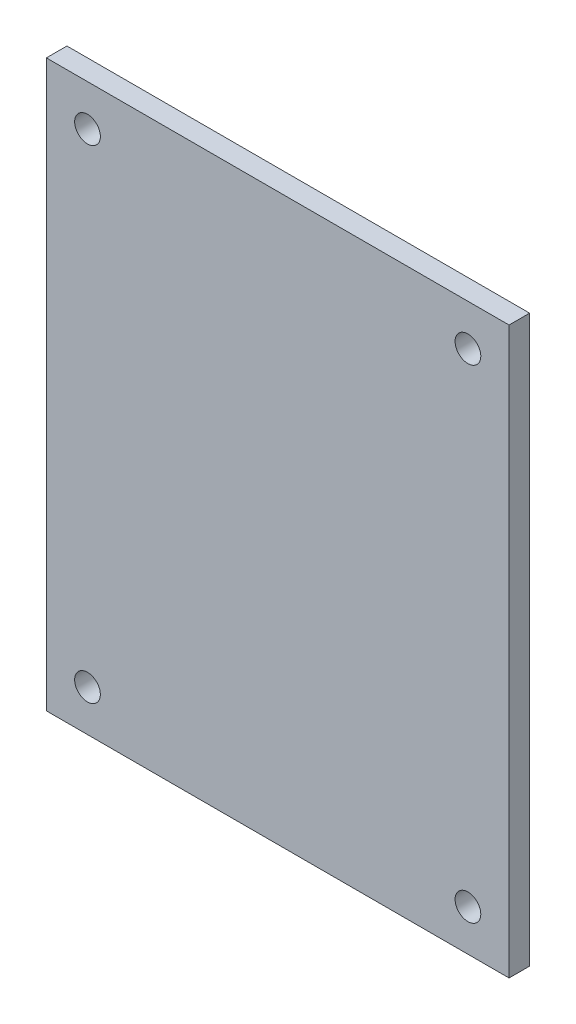
ISO-10303-21;
HEADER;
FILE_DESCRIPTION(('STEP AP214'),'2;1');
FILE_NAME('part.step','',(''),(''),'','','');
FILE_SCHEMA(('AUTOMOTIVE_DESIGN { 1 0 10303 214 1 1 1 1 }'));
ENDSEC;
DATA;
#1=APPLICATION_CONTEXT('core data for automotive mechanical design processes');
#2=APPLICATION_PROTOCOL_DEFINITION('international standard','automotive_design',2000,#1);
#3=PRODUCT_CONTEXT('',#1,'mechanical');
#4=PRODUCT('Part','Part','',(#3));
#5=PRODUCT_RELATED_PRODUCT_CATEGORY('part','',(#4));
#6=PRODUCT_DEFINITION_FORMATION('','',#4);
#7=PRODUCT_DEFINITION_CONTEXT('part definition',#1,'design');
#8=PRODUCT_DEFINITION('design','',#6,#7);
#9=PRODUCT_DEFINITION_SHAPE('','',#8);
#10=(LENGTH_UNIT() NAMED_UNIT(*) SI_UNIT(.MILLI.,.METRE.));
#11=(NAMED_UNIT(*) PLANE_ANGLE_UNIT() SI_UNIT($,.RADIAN.));
#12=(NAMED_UNIT(*) SI_UNIT($,.STERADIAN.) SOLID_ANGLE_UNIT());
#13=UNCERTAINTY_MEASURE_WITH_UNIT(LENGTH_MEASURE(1.E-05),#10,'distance_accuracy_value','');
#14=(GEOMETRIC_REPRESENTATION_CONTEXT(3) GLOBAL_UNCERTAINTY_ASSIGNED_CONTEXT((#13)) GLOBAL_UNIT_ASSIGNED_CONTEXT((#10,
#11,#12)) REPRESENTATION_CONTEXT('',''));
#15=CARTESIAN_POINT('',(0.,0.,0.));
#16=DIRECTION('',(0.,0.,1.));
#17=DIRECTION('',(1.,0.,0.));
#18=AXIS2_PLACEMENT_3D('',#15,#16,#17);
#19=CARTESIAN_POINT('',(0.,0.,2.));
#20=DIRECTION('',(0.,0.,-1.));
#21=DIRECTION('',(-1.,0.,0.));
#22=AXIS2_PLACEMENT_3D('',#19,#20,#21);
#23=PLANE('',#22);
#24=DIRECTION('',(0.,1.,0.));
#25=VECTOR('',#24,1.);
#26=CARTESIAN_POINT('',(22.5,-27.5,2.));
#27=LINE('',#26,#25);
#28=CARTESIAN_POINT('',(22.5,-27.5,2.));
#29=VERTEX_POINT('',#28);
#30=CARTESIAN_POINT('',(22.5,27.5,2.));
#31=VERTEX_POINT('',#30);
#32=EDGE_CURVE('E85',#29,#31,#27,.T.);
#33=ORIENTED_EDGE('',*,*,#32,.T.);
#34=DIRECTION('',(-1.,0.,0.));
#35=VECTOR('',#34,1.);
#36=CARTESIAN_POINT('',(-22.5,27.5,2.));
#37=LINE('',#36,#35);
#38=CARTESIAN_POINT('',(-22.5,27.5,2.));
#39=VERTEX_POINT('',#38);
#40=EDGE_CURVE('E80',#31,#39,#37,.T.);
#41=ORIENTED_EDGE('',*,*,#40,.T.);
#42=DIRECTION('',(0.,-1.,0.));
#43=VECTOR('',#42,1.);
#44=CARTESIAN_POINT('',(-22.5,-27.5,2.));
#45=LINE('',#44,#43);
#46=CARTESIAN_POINT('',(-22.5,-27.5,2.));
#47=VERTEX_POINT('',#46);
#48=EDGE_CURVE('E83',#39,#47,#45,.T.);
#49=ORIENTED_EDGE('',*,*,#48,.T.);
#50=DIRECTION('',(1.,0.,0.));
#51=VECTOR('',#50,1.);
#52=CARTESIAN_POINT('',(-22.5,-27.5,2.));
#53=LINE('',#52,#51);
#54=EDGE_CURVE('E50',#47,#29,#53,.T.);
#55=ORIENTED_EDGE('',*,*,#54,.T.);
#56=EDGE_LOOP('',(#33,#41,#49,#55));
#57=FACE_BOUND('',#56,.T.);
#58=CARTESIAN_POINT('',(-18.5,23.5,2.));
#59=DIRECTION('',(0.,0.,1.));
#60=DIRECTION('',(1.,0.,0.));
#61=AXIS2_PLACEMENT_3D('',#58,#59,#60);
#62=CIRCLE('',#61,1.25);
#63=CARTESIAN_POINT('',(-17.25,23.5,2.));
#64=VERTEX_POINT('',#63);
#65=EDGE_CURVE('E100',#64,#64,#62,.T.);
#66=ORIENTED_EDGE('',*,*,#65,.F.);
#67=EDGE_LOOP('',(#66));
#68=FACE_BOUND('',#67,.T.);
#69=CARTESIAN_POINT('',(18.5,23.5,2.));
#70=DIRECTION('',(0.,0.,1.));
#71=DIRECTION('',(-1.,0.,0.));
#72=AXIS2_PLACEMENT_3D('',#69,#70,#71);
#73=CIRCLE('',#72,1.25);
#74=CARTESIAN_POINT('',(17.25,23.5,2.));
#75=VERTEX_POINT('',#74);
#76=EDGE_CURVE('E115',#75,#75,#73,.T.);
#77=ORIENTED_EDGE('',*,*,#76,.F.);
#78=EDGE_LOOP('',(#77));
#79=FACE_BOUND('',#78,.T.);
#80=CARTESIAN_POINT('',(18.5,-23.5,2.));
#81=DIRECTION('',(0.,0.,1.));
#82=DIRECTION('',(1.,0.,0.));
#83=AXIS2_PLACEMENT_3D('',#80,#81,#82);
#84=CIRCLE('',#83,1.25);
#85=CARTESIAN_POINT('',(19.75,-23.5,2.));
#86=VERTEX_POINT('',#85);
#87=EDGE_CURVE('E121',#86,#86,#84,.T.);
#88=ORIENTED_EDGE('',*,*,#87,.F.);
#89=EDGE_LOOP('',(#88));
#90=FACE_BOUND('',#89,.T.);
#91=CARTESIAN_POINT('',(-18.5,-23.5,2.));
#92=DIRECTION('',(0.,0.,1.));
#93=DIRECTION('',(-1.,0.,0.));
#94=AXIS2_PLACEMENT_3D('',#91,#92,#93);
#95=CIRCLE('',#94,1.25);
#96=CARTESIAN_POINT('',(-19.75,-23.5,2.));
#97=VERTEX_POINT('',#96);
#98=EDGE_CURVE('E127',#97,#97,#95,.T.);
#99=ORIENTED_EDGE('',*,*,#98,.F.);
#100=EDGE_LOOP('',(#99));
#101=FACE_BOUND('',#100,.T.);
#102=ADVANCED_FACE('F33',(#57,#68,#79,#90,#101),#23,.F.);
#103=CARTESIAN_POINT('',(0.,0.,0.));
#104=DIRECTION('',(0.,0.,-1.));
#105=DIRECTION('',(-1.,0.,0.));
#106=AXIS2_PLACEMENT_3D('',#103,#104,#105);
#107=PLANE('',#106);
#108=CARTESIAN_POINT('',(18.5,-23.5,0.));
#109=DIRECTION('',(0.,0.,1.));
#110=DIRECTION('',(1.,0.,0.));
#111=AXIS2_PLACEMENT_3D('',#108,#109,#110);
#112=CIRCLE('',#111,1.25);
#113=CARTESIAN_POINT('',(19.75,-23.5,0.));
#114=VERTEX_POINT('',#113);
#115=EDGE_CURVE('E124',#114,#114,#112,.T.);
#116=ORIENTED_EDGE('',*,*,#115,.T.);
#117=EDGE_LOOP('',(#116));
#118=FACE_BOUND('',#117,.T.);
#119=CARTESIAN_POINT('',(-18.5,23.5,0.));
#120=DIRECTION('',(0.,0.,1.));
#121=DIRECTION('',(1.,0.,0.));
#122=AXIS2_PLACEMENT_3D('',#119,#120,#121);
#123=CIRCLE('',#122,1.25);
#124=CARTESIAN_POINT('',(-17.25,23.5,0.));
#125=VERTEX_POINT('',#124);
#126=EDGE_CURVE('E112',#125,#125,#123,.T.);
#127=ORIENTED_EDGE('',*,*,#126,.T.);
#128=EDGE_LOOP('',(#127));
#129=FACE_BOUND('',#128,.T.);
#130=DIRECTION('',(0.,1.,0.));
#131=VECTOR('',#130,1.);
#132=CARTESIAN_POINT('',(22.5,-27.5,0.));
#133=LINE('',#132,#131);
#134=CARTESIAN_POINT('',(22.5,-27.5,0.));
#135=VERTEX_POINT('',#134);
#136=CARTESIAN_POINT('',(22.5,27.5,0.));
#137=VERTEX_POINT('',#136);
#138=EDGE_CURVE('E97',#135,#137,#133,.T.);
#139=ORIENTED_EDGE('',*,*,#138,.F.);
#140=DIRECTION('',(1.,0.,0.));
#141=VECTOR('',#140,1.);
#142=CARTESIAN_POINT('',(-22.5,-27.5,0.));
#143=LINE('',#142,#141);
#144=CARTESIAN_POINT('',(-22.5,-27.5,0.));
#145=VERTEX_POINT('',#144);
#146=EDGE_CURVE('E73',#145,#135,#143,.T.);
#147=ORIENTED_EDGE('',*,*,#146,.F.);
#148=DIRECTION('',(0.,-1.,0.));
#149=VECTOR('',#148,1.);
#150=CARTESIAN_POINT('',(-22.5,-27.5,0.));
#151=LINE('',#150,#149);
#152=CARTESIAN_POINT('',(-22.5,27.5,0.));
#153=VERTEX_POINT('',#152);
#154=EDGE_CURVE('E67',#153,#145,#151,.T.);
#155=ORIENTED_EDGE('',*,*,#154,.F.);
#156=DIRECTION('',(-1.,0.,0.));
#157=VECTOR('',#156,1.);
#158=CARTESIAN_POINT('',(-22.5,27.5,0.));
#159=LINE('',#158,#157);
#160=EDGE_CURVE('E89',#137,#153,#159,.T.);
#161=ORIENTED_EDGE('',*,*,#160,.F.);
#162=EDGE_LOOP('',(#139,#147,#155,#161));
#163=FACE_BOUND('',#162,.T.);
#164=CARTESIAN_POINT('',(18.5,23.5,0.));
#165=DIRECTION('',(0.,0.,1.));
#166=DIRECTION('',(-1.,0.,0.));
#167=AXIS2_PLACEMENT_3D('',#164,#165,#166);
#168=CIRCLE('',#167,1.25);
#169=CARTESIAN_POINT('',(17.25,23.5,0.));
#170=VERTEX_POINT('',#169);
#171=EDGE_CURVE('E118',#170,#170,#168,.T.);
#172=ORIENTED_EDGE('',*,*,#171,.T.);
#173=EDGE_LOOP('',(#172));
#174=FACE_BOUND('',#173,.T.);
#175=CARTESIAN_POINT('',(-18.5,-23.5,0.));
#176=DIRECTION('',(0.,0.,1.));
#177=DIRECTION('',(-1.,0.,0.));
#178=AXIS2_PLACEMENT_3D('',#175,#176,#177);
#179=CIRCLE('',#178,1.25);
#180=CARTESIAN_POINT('',(-19.75,-23.5,0.));
#181=VERTEX_POINT('',#180);
#182=EDGE_CURVE('E130',#181,#181,#179,.T.);
#183=ORIENTED_EDGE('',*,*,#182,.T.);
#184=EDGE_LOOP('',(#183));
#185=FACE_BOUND('',#184,.T.);
#186=ADVANCED_FACE('F108',(#118,#129,#163,#174,#185),#107,.T.);
#187=CARTESIAN_POINT('',(22.5,-27.5,2.));
#188=DIRECTION('',(-1.,0.,0.));
#189=DIRECTION('',(0.,-1.,0.));
#190=AXIS2_PLACEMENT_3D('',#187,#188,#189);
#191=PLANE('',#190);
#192=ORIENTED_EDGE('',*,*,#138,.T.);
#193=DIRECTION('',(0.,0.,-1.));
#194=VECTOR('',#193,1.);
#195=CARTESIAN_POINT('',(22.5,27.5,2.));
#196=LINE('',#195,#194);
#197=EDGE_CURVE('E11',#31,#137,#196,.T.);
#198=ORIENTED_EDGE('',*,*,#197,.F.);
#199=ORIENTED_EDGE('',*,*,#32,.F.);
#200=DIRECTION('',(0.,0.,-1.));
#201=VECTOR('',#200,1.);
#202=CARTESIAN_POINT('',(22.5,-27.5,2.));
#203=LINE('',#202,#201);
#204=EDGE_CURVE('E93',#29,#135,#203,.T.);
#205=ORIENTED_EDGE('',*,*,#204,.T.);
#206=EDGE_LOOP('',(#192,#198,#199,#205));
#207=FACE_BOUND('',#206,.T.);
#208=ADVANCED_FACE('F35',(#207),#191,.F.);
#209=CARTESIAN_POINT('',(-22.5,27.5,2.));
#210=DIRECTION('',(0.,-1.,0.));
#211=DIRECTION('',(0.,0.,-1.));
#212=AXIS2_PLACEMENT_3D('',#209,#210,#211);
#213=PLANE('',#212);
#214=ORIENTED_EDGE('',*,*,#160,.T.);
#215=DIRECTION('',(0.,0.,-1.));
#216=VECTOR('',#215,1.);
#217=CARTESIAN_POINT('',(-22.5,27.5,2.));
#218=LINE('',#217,#216);
#219=EDGE_CURVE('E42',#39,#153,#218,.T.);
#220=ORIENTED_EDGE('',*,*,#219,.F.);
#221=ORIENTED_EDGE('',*,*,#40,.F.);
#222=ORIENTED_EDGE('',*,*,#197,.T.);
#223=EDGE_LOOP('',(#214,#220,#221,#222));
#224=FACE_BOUND('',#223,.T.);
#225=ADVANCED_FACE('F88',(#224),#213,.F.);
#226=CARTESIAN_POINT('',(-22.5,-27.5,2.));
#227=DIRECTION('',(1.,0.,0.));
#228=DIRECTION('',(0.,1.,0.));
#229=AXIS2_PLACEMENT_3D('',#226,#227,#228);
#230=PLANE('',#229);
#231=ORIENTED_EDGE('',*,*,#154,.T.);
#232=DIRECTION('',(0.,0.,-1.));
#233=VECTOR('',#232,1.);
#234=CARTESIAN_POINT('',(-22.5,-27.5,2.));
#235=LINE('',#234,#233);
#236=EDGE_CURVE('E90',#47,#145,#235,.T.);
#237=ORIENTED_EDGE('',*,*,#236,.F.);
#238=ORIENTED_EDGE('',*,*,#48,.F.);
#239=ORIENTED_EDGE('',*,*,#219,.T.);
#240=EDGE_LOOP('',(#231,#237,#238,#239));
#241=FACE_BOUND('',#240,.T.);
#242=ADVANCED_FACE('F91',(#241),#230,.F.);
#243=CARTESIAN_POINT('',(-22.5,-27.5,2.));
#244=DIRECTION('',(0.,1.,0.));
#245=DIRECTION('',(0.,0.,1.));
#246=AXIS2_PLACEMENT_3D('',#243,#244,#245);
#247=PLANE('',#246);
#248=ORIENTED_EDGE('',*,*,#146,.T.);
#249=ORIENTED_EDGE('',*,*,#204,.F.);
#250=ORIENTED_EDGE('',*,*,#54,.F.);
#251=ORIENTED_EDGE('',*,*,#236,.T.);
#252=EDGE_LOOP('',(#248,#249,#250,#251));
#253=FACE_BOUND('',#252,.T.);
#254=ADVANCED_FACE('F105',(#253),#247,.F.);
#255=CARTESIAN_POINT('',(-18.5,23.5,2.));
#256=DIRECTION('',(0.,0.,-1.));
#257=DIRECTION('',(-1.,0.,0.));
#258=AXIS2_PLACEMENT_3D('',#255,#256,#257);
#259=CYLINDRICAL_SURFACE('',#258,1.25);
#260=ORIENTED_EDGE('',*,*,#65,.T.);
#261=EDGE_LOOP('',(#260));
#262=FACE_BOUND('',#261,.T.);
#263=ORIENTED_EDGE('',*,*,#126,.F.);
#264=EDGE_LOOP('',(#263));
#265=FACE_BOUND('',#264,.T.);
#266=ADVANCED_FACE('F147',(#262,#265),#259,.F.);
#267=CARTESIAN_POINT('',(18.5,23.5,2.));
#268=DIRECTION('',(0.,0.,-1.));
#269=DIRECTION('',(-1.,0.,0.));
#270=AXIS2_PLACEMENT_3D('',#267,#268,#269);
#271=CYLINDRICAL_SURFACE('',#270,1.25);
#272=ORIENTED_EDGE('',*,*,#76,.T.);
#273=EDGE_LOOP('',(#272));
#274=FACE_BOUND('',#273,.T.);
#275=ORIENTED_EDGE('',*,*,#171,.F.);
#276=EDGE_LOOP('',(#275));
#277=FACE_BOUND('',#276,.T.);
#278=ADVANCED_FACE('F193',(#274,#277),#271,.F.);
#279=CARTESIAN_POINT('',(18.5,-23.5,2.));
#280=DIRECTION('',(0.,0.,-1.));
#281=DIRECTION('',(-1.,0.,0.));
#282=AXIS2_PLACEMENT_3D('',#279,#280,#281);
#283=CYLINDRICAL_SURFACE('',#282,1.25);
#284=ORIENTED_EDGE('',*,*,#87,.T.);
#285=EDGE_LOOP('',(#284));
#286=FACE_BOUND('',#285,.T.);
#287=ORIENTED_EDGE('',*,*,#115,.F.);
#288=EDGE_LOOP('',(#287));
#289=FACE_BOUND('',#288,.T.);
#290=ADVANCED_FACE('F201',(#286,#289),#283,.F.);
#291=CARTESIAN_POINT('',(-18.5,-23.5,2.));
#292=DIRECTION('',(0.,0.,-1.));
#293=DIRECTION('',(-1.,0.,0.));
#294=AXIS2_PLACEMENT_3D('',#291,#292,#293);
#295=CYLINDRICAL_SURFACE('',#294,1.25);
#296=ORIENTED_EDGE('',*,*,#98,.T.);
#297=EDGE_LOOP('',(#296));
#298=FACE_BOUND('',#297,.T.);
#299=ORIENTED_EDGE('',*,*,#182,.F.);
#300=EDGE_LOOP('',(#299));
#301=FACE_BOUND('',#300,.T.);
#302=ADVANCED_FACE('F136',(#298,#301),#295,.F.);
#303=CLOSED_SHELL('',(#102,#186,#208,#225,#242,#254,#266,#278,#290,#302));
#304=MANIFOLD_SOLID_BREP('B2',#303);
#305=ADVANCED_BREP_SHAPE_REPRESENTATION('',(#18,#304),#14);
#306=SHAPE_DEFINITION_REPRESENTATION(#9,#305);
ENDSEC;
END-ISO-10303-21;
